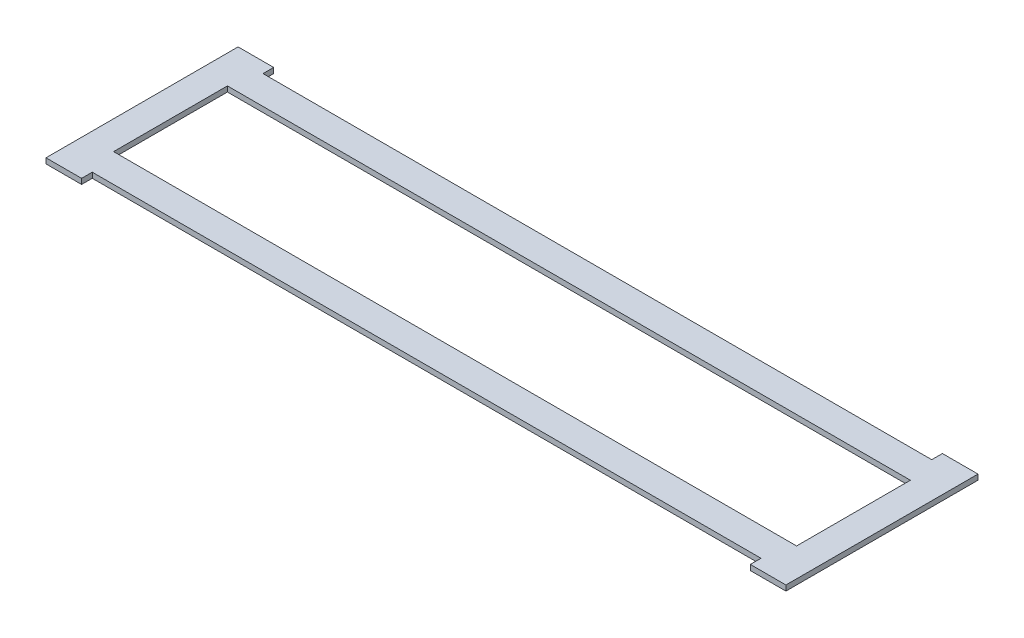
ISO-10303-21;
HEADER;
FILE_DESCRIPTION(('STEP AP214'),'2;1');
FILE_NAME('part.step','',(''),(''),'','','');
FILE_SCHEMA(('AUTOMOTIVE_DESIGN { 1 0 10303 214 1 1 1 1 }'));
ENDSEC;
DATA;
#1=APPLICATION_CONTEXT('core data for automotive mechanical design processes');
#2=APPLICATION_PROTOCOL_DEFINITION('international standard','automotive_design',2000,#1);
#3=PRODUCT_CONTEXT('',#1,'mechanical');
#4=PRODUCT('Part','Part','',(#3));
#5=PRODUCT_RELATED_PRODUCT_CATEGORY('part','',(#4));
#6=PRODUCT_DEFINITION_FORMATION('','',#4);
#7=PRODUCT_DEFINITION_CONTEXT('part definition',#1,'design');
#8=PRODUCT_DEFINITION('design','',#6,#7);
#9=PRODUCT_DEFINITION_SHAPE('','',#8);
#10=(LENGTH_UNIT() NAMED_UNIT(*) SI_UNIT(.MILLI.,.METRE.));
#11=(NAMED_UNIT(*) PLANE_ANGLE_UNIT() SI_UNIT($,.RADIAN.));
#12=(NAMED_UNIT(*) SI_UNIT($,.STERADIAN.) SOLID_ANGLE_UNIT());
#13=UNCERTAINTY_MEASURE_WITH_UNIT(LENGTH_MEASURE(1.E-05),#10,'distance_accuracy_value','');
#14=(GEOMETRIC_REPRESENTATION_CONTEXT(3) GLOBAL_UNCERTAINTY_ASSIGNED_CONTEXT((#13)) GLOBAL_UNIT_ASSIGNED_CONTEXT((#10,
#11,#12)) REPRESENTATION_CONTEXT('',''));
#15=CARTESIAN_POINT('',(0.,0.,0.));
#16=DIRECTION('',(0.,0.,1.));
#17=DIRECTION('',(1.,0.,0.));
#18=AXIS2_PLACEMENT_3D('',#15,#16,#17);
#19=CARTESIAN_POINT('',(0.,3.,-32.));
#20=DIRECTION('',(0.,0.,-1.));
#21=DIRECTION('',(-1.,0.,0.));
#22=AXIS2_PLACEMENT_3D('',#19,#20,#21);
#23=PLANE('',#22);
#24=DIRECTION('',(1.,0.,0.));
#25=VECTOR('',#24,1.);
#26=CARTESIAN_POINT('',(0.,0.,-32.));
#27=LINE('',#26,#25);
#28=CARTESIAN_POINT('',(-192.,0.,-32.));
#29=VERTEX_POINT('',#28);
#30=CARTESIAN_POINT('',(192.,0.,-32.));
#31=VERTEX_POINT('',#30);
#32=EDGE_CURVE('E214',#29,#31,#27,.T.);
#33=ORIENTED_EDGE('',*,*,#32,.T.);
#34=DIRECTION('',(0.,-1.,0.));
#35=VECTOR('',#34,1.);
#36=CARTESIAN_POINT('',(192.,3.,-32.));
#37=LINE('',#36,#35);
#38=CARTESIAN_POINT('',(192.,3.,-32.));
#39=VERTEX_POINT('',#38);
#40=EDGE_CURVE('E11',#39,#31,#37,.T.);
#41=ORIENTED_EDGE('',*,*,#40,.F.);
#42=DIRECTION('',(1.,0.,0.));
#43=VECTOR('',#42,1.);
#44=CARTESIAN_POINT('',(0.,3.,-32.));
#45=LINE('',#44,#43);
#46=CARTESIAN_POINT('',(-192.,3.,-32.));
#47=VERTEX_POINT('',#46);
#48=EDGE_CURVE('E163',#47,#39,#45,.T.);
#49=ORIENTED_EDGE('',*,*,#48,.F.);
#50=DIRECTION('',(0.,-1.,0.));
#51=VECTOR('',#50,1.);
#52=CARTESIAN_POINT('',(-192.,3.,-32.));
#53=LINE('',#52,#51);
#54=EDGE_CURVE('E55',#47,#29,#53,.T.);
#55=ORIENTED_EDGE('',*,*,#54,.T.);
#56=EDGE_LOOP('',(#33,#41,#49,#55));
#57=FACE_BOUND('',#56,.T.);
#58=ADVANCED_FACE('F36',(#57),#23,.F.);
#59=CARTESIAN_POINT('',(192.,3.,0.));
#60=DIRECTION('',(1.,0.,0.));
#61=DIRECTION('',(0.,0.,-1.));
#62=AXIS2_PLACEMENT_3D('',#59,#60,#61);
#63=PLANE('',#62);
#64=DIRECTION('',(0.,0.,1.));
#65=VECTOR('',#64,1.);
#66=CARTESIAN_POINT('',(192.,0.,0.));
#67=LINE('',#66,#65);
#68=CARTESIAN_POINT('',(192.,0.,32.));
#69=VERTEX_POINT('',#68);
#70=EDGE_CURVE('E169',#31,#69,#67,.T.);
#71=ORIENTED_EDGE('',*,*,#70,.T.);
#72=DIRECTION('',(0.,-1.,0.));
#73=VECTOR('',#72,1.);
#74=CARTESIAN_POINT('',(192.,3.,32.));
#75=LINE('',#74,#73);
#76=CARTESIAN_POINT('',(192.,3.,32.));
#77=VERTEX_POINT('',#76);
#78=EDGE_CURVE('E46',#77,#69,#75,.T.);
#79=ORIENTED_EDGE('',*,*,#78,.F.);
#80=DIRECTION('',(0.,0.,1.));
#81=VECTOR('',#80,1.);
#82=CARTESIAN_POINT('',(192.,3.,0.));
#83=LINE('',#82,#81);
#84=EDGE_CURVE('E157',#39,#77,#83,.T.);
#85=ORIENTED_EDGE('',*,*,#84,.F.);
#86=ORIENTED_EDGE('',*,*,#40,.T.);
#87=EDGE_LOOP('',(#71,#79,#85,#86));
#88=FACE_BOUND('',#87,.T.);
#89=ADVANCED_FACE('F168',(#88),#63,.F.);
#90=CARTESIAN_POINT('',(0.,3.,32.));
#91=DIRECTION('',(0.,0.,-1.));
#92=DIRECTION('',(-1.,0.,0.));
#93=AXIS2_PLACEMENT_3D('',#90,#91,#92);
#94=PLANE('',#93);
#95=DIRECTION('',(1.,0.,0.));
#96=VECTOR('',#95,1.);
#97=CARTESIAN_POINT('',(0.,0.,32.));
#98=LINE('',#97,#96);
#99=CARTESIAN_POINT('',(-192.,0.,32.));
#100=VERTEX_POINT('',#99);
#101=EDGE_CURVE('E217',#100,#69,#98,.T.);
#102=ORIENTED_EDGE('',*,*,#101,.F.);
#103=DIRECTION('',(0.,-1.,0.));
#104=VECTOR('',#103,1.);
#105=CARTESIAN_POINT('',(-192.,3.,32.));
#106=LINE('',#105,#104);
#107=CARTESIAN_POINT('',(-192.,3.,32.));
#108=VERTEX_POINT('',#107);
#109=EDGE_CURVE('E105',#108,#100,#106,.T.);
#110=ORIENTED_EDGE('',*,*,#109,.F.);
#111=DIRECTION('',(1.,0.,0.));
#112=VECTOR('',#111,1.);
#113=CARTESIAN_POINT('',(0.,3.,32.));
#114=LINE('',#113,#112);
#115=EDGE_CURVE('E162',#108,#77,#114,.T.);
#116=ORIENTED_EDGE('',*,*,#115,.T.);
#117=ORIENTED_EDGE('',*,*,#78,.T.);
#118=EDGE_LOOP('',(#102,#110,#116,#117));
#119=FACE_BOUND('',#118,.T.);
#120=ADVANCED_FACE('F173',(#119),#94,.T.);
#121=CARTESIAN_POINT('',(208.,3.,0.));
#122=DIRECTION('',(1.,0.,0.));
#123=DIRECTION('',(0.,0.,-1.));
#124=AXIS2_PLACEMENT_3D('',#121,#122,#123);
#125=PLANE('',#124);
#126=DIRECTION('',(0.,0.,1.));
#127=VECTOR('',#126,1.);
#128=CARTESIAN_POINT('',(208.,0.,0.));
#129=LINE('',#128,#127);
#130=CARTESIAN_POINT('',(208.,0.,-54.0000000000004));
#131=VERTEX_POINT('',#130);
#132=CARTESIAN_POINT('',(208.,0.,54.0000000000003));
#133=VERTEX_POINT('',#132);
#134=EDGE_CURVE('E180',#131,#133,#129,.T.);
#135=ORIENTED_EDGE('',*,*,#134,.F.);
#136=DIRECTION('',(0.,-1.,0.));
#137=VECTOR('',#136,1.);
#138=CARTESIAN_POINT('',(208.,3.,-54.0000000000004));
#139=LINE('',#138,#137);
#140=CARTESIAN_POINT('',(208.,3.,-54.0000000000004));
#141=VERTEX_POINT('',#140);
#142=EDGE_CURVE('E40',#141,#131,#139,.T.);
#143=ORIENTED_EDGE('',*,*,#142,.F.);
#144=DIRECTION('',(0.,0.,1.));
#145=VECTOR('',#144,1.);
#146=CARTESIAN_POINT('',(208.,3.,0.));
#147=LINE('',#146,#145);
#148=CARTESIAN_POINT('',(208.,3.,54.0000000000003));
#149=VERTEX_POINT('',#148);
#150=EDGE_CURVE('E222',#141,#149,#147,.T.);
#151=ORIENTED_EDGE('',*,*,#150,.T.);
#152=DIRECTION('',(0.,-1.,0.));
#153=VECTOR('',#152,1.);
#154=CARTESIAN_POINT('',(208.,3.,54.0000000000003));
#155=LINE('',#154,#153);
#156=EDGE_CURVE('E176',#149,#133,#155,.T.);
#157=ORIENTED_EDGE('',*,*,#156,.T.);
#158=EDGE_LOOP('',(#135,#143,#151,#157));
#159=FACE_BOUND('',#158,.T.);
#160=ADVANCED_FACE('F38',(#159),#125,.T.);
#161=CARTESIAN_POINT('',(-1.12375470551405E-13,3.,-53.9999999999999));
#162=DIRECTION('',(0.,0.,1.));
#163=DIRECTION('',(1.,0.,0.));
#164=AXIS2_PLACEMENT_3D('',#161,#162,#163);
#165=PLANE('',#164);
#166=DIRECTION('',(-1.,0.,0.));
#167=VECTOR('',#166,1.);
#168=CARTESIAN_POINT('',(-1.12375470551405E-13,0.,-53.9999999999999));
#169=LINE('',#168,#167);
#170=CARTESIAN_POINT('',(187.993840169616,0.,-54.0000000000003));
#171=VERTEX_POINT('',#170);
#172=EDGE_CURVE('E183',#131,#171,#169,.T.);
#173=ORIENTED_EDGE('',*,*,#172,.T.);
#174=DIRECTION('',(0.,-1.,0.));
#175=VECTOR('',#174,1.);
#176=CARTESIAN_POINT('',(187.993840169616,3.,-54.0000000000003));
#177=LINE('',#176,#175);
#178=CARTESIAN_POINT('',(187.993840169616,3.,-54.0000000000003));
#179=VERTEX_POINT('',#178);
#180=EDGE_CURVE('E245',#179,#171,#177,.T.);
#181=ORIENTED_EDGE('',*,*,#180,.F.);
#182=DIRECTION('',(-1.,0.,0.));
#183=VECTOR('',#182,1.);
#184=CARTESIAN_POINT('',(-1.12375470551405E-13,3.,-53.9999999999999));
#185=LINE('',#184,#183);
#186=EDGE_CURVE('E253',#141,#179,#185,.T.);
#187=ORIENTED_EDGE('',*,*,#186,.F.);
#188=ORIENTED_EDGE('',*,*,#142,.T.);
#189=EDGE_LOOP('',(#173,#181,#187,#188));
#190=FACE_BOUND('',#189,.T.);
#191=ADVANCED_FACE('F252',(#190),#165,.F.);
#192=CARTESIAN_POINT('',(187.993840169616,3.,0.));
#193=DIRECTION('',(-1.,0.,0.));
#194=DIRECTION('',(0.,0.,1.));
#195=AXIS2_PLACEMENT_3D('',#192,#193,#194);
#196=PLANE('',#195);
#197=DIRECTION('',(0.,0.,-1.));
#198=VECTOR('',#197,1.);
#199=CARTESIAN_POINT('',(187.993840169616,0.,0.));
#200=LINE('',#199,#198);
#201=CARTESIAN_POINT('',(187.993840169616,0.,-48.));
#202=VERTEX_POINT('',#201);
#203=EDGE_CURVE('E186',#202,#171,#200,.T.);
#204=ORIENTED_EDGE('',*,*,#203,.F.);
#205=DIRECTION('',(0.,-1.,0.));
#206=VECTOR('',#205,1.);
#207=CARTESIAN_POINT('',(187.993840169616,3.,-48.));
#208=LINE('',#207,#206);
#209=CARTESIAN_POINT('',(187.993840169616,3.,-48.));
#210=VERTEX_POINT('',#209);
#211=EDGE_CURVE('E244',#210,#202,#208,.T.);
#212=ORIENTED_EDGE('',*,*,#211,.F.);
#213=DIRECTION('',(0.,0.,-1.));
#214=VECTOR('',#213,1.);
#215=CARTESIAN_POINT('',(187.993840169616,3.,0.));
#216=LINE('',#215,#214);
#217=EDGE_CURVE('E494',#210,#179,#216,.T.);
#218=ORIENTED_EDGE('',*,*,#217,.T.);
#219=ORIENTED_EDGE('',*,*,#180,.T.);
#220=EDGE_LOOP('',(#204,#212,#218,#219));
#221=FACE_BOUND('',#220,.T.);
#222=ADVANCED_FACE('F311',(#221),#196,.T.);
#223=CARTESIAN_POINT('',(0.,3.,-48.));
#224=DIRECTION('',(0.,0.,-1.));
#225=DIRECTION('',(-1.,0.,0.));
#226=AXIS2_PLACEMENT_3D('',#223,#224,#225);
#227=PLANE('',#226);
#228=DIRECTION('',(1.,0.,0.));
#229=VECTOR('',#228,1.);
#230=CARTESIAN_POINT('',(0.,0.,-48.));
#231=LINE('',#230,#229);
#232=CARTESIAN_POINT('',(-187.993840169617,0.,-48.));
#233=VERTEX_POINT('',#232);
#234=EDGE_CURVE('E189',#233,#202,#231,.T.);
#235=ORIENTED_EDGE('',*,*,#234,.F.);
#236=DIRECTION('',(0.,-1.,0.));
#237=VECTOR('',#236,1.);
#238=CARTESIAN_POINT('',(-187.993840169617,3.,-48.));
#239=LINE('',#238,#237);
#240=CARTESIAN_POINT('',(-187.993840169617,3.,-48.));
#241=VERTEX_POINT('',#240);
#242=EDGE_CURVE('E242',#241,#233,#239,.T.);
#243=ORIENTED_EDGE('',*,*,#242,.F.);
#244=DIRECTION('',(1.,0.,0.));
#245=VECTOR('',#244,1.);
#246=CARTESIAN_POINT('',(0.,3.,-48.));
#247=LINE('',#246,#245);
#248=EDGE_CURVE('E309',#241,#210,#247,.T.);
#249=ORIENTED_EDGE('',*,*,#248,.T.);
#250=ORIENTED_EDGE('',*,*,#211,.T.);
#251=EDGE_LOOP('',(#235,#243,#249,#250));
#252=FACE_BOUND('',#251,.T.);
#253=ADVANCED_FACE('F305',(#252),#227,.T.);
#254=CARTESIAN_POINT('',(-187.993840169617,3.,0.));
#255=DIRECTION('',(-1.,0.,0.));
#256=DIRECTION('',(0.,0.,1.));
#257=AXIS2_PLACEMENT_3D('',#254,#255,#256);
#258=PLANE('',#257);
#259=DIRECTION('',(0.,0.,-1.));
#260=VECTOR('',#259,1.);
#261=CARTESIAN_POINT('',(-187.993840169617,0.,0.));
#262=LINE('',#261,#260);
#263=CARTESIAN_POINT('',(-187.993840169617,0.,-54.));
#264=VERTEX_POINT('',#263);
#265=EDGE_CURVE('E192',#233,#264,#262,.T.);
#266=ORIENTED_EDGE('',*,*,#265,.T.);
#267=DIRECTION('',(0.,-1.,0.));
#268=VECTOR('',#267,1.);
#269=CARTESIAN_POINT('',(-187.993840169617,3.,-54.));
#270=LINE('',#269,#268);
#271=CARTESIAN_POINT('',(-187.993840169617,3.,-54.));
#272=VERTEX_POINT('',#271);
#273=EDGE_CURVE('E240',#272,#264,#270,.T.);
#274=ORIENTED_EDGE('',*,*,#273,.F.);
#275=DIRECTION('',(0.,0.,-1.));
#276=VECTOR('',#275,1.);
#277=CARTESIAN_POINT('',(-187.993840169617,3.,0.));
#278=LINE('',#277,#276);
#279=EDGE_CURVE('E499',#241,#272,#278,.T.);
#280=ORIENTED_EDGE('',*,*,#279,.F.);
#281=ORIENTED_EDGE('',*,*,#242,.T.);
#282=EDGE_LOOP('',(#266,#274,#280,#281));
#283=FACE_BOUND('',#282,.T.);
#284=ADVANCED_FACE('F318',(#283),#258,.F.);
#285=CARTESIAN_POINT('',(0.,3.,-54.));
#286=DIRECTION('',(0.,0.,-1.));
#287=DIRECTION('',(-1.,0.,0.));
#288=AXIS2_PLACEMENT_3D('',#285,#286,#287);
#289=PLANE('',#288);
#290=DIRECTION('',(1.,0.,0.));
#291=VECTOR('',#290,1.);
#292=CARTESIAN_POINT('',(0.,0.,-54.));
#293=LINE('',#292,#291);
#294=CARTESIAN_POINT('',(-208.,0.,-54.));
#295=VERTEX_POINT('',#294);
#296=EDGE_CURVE('E195',#295,#264,#293,.T.);
#297=ORIENTED_EDGE('',*,*,#296,.F.);
#298=DIRECTION('',(0.,-1.,0.));
#299=VECTOR('',#298,1.);
#300=CARTESIAN_POINT('',(-208.,3.,-54.));
#301=LINE('',#300,#299);
#302=CARTESIAN_POINT('',(-208.,3.,-54.));
#303=VERTEX_POINT('',#302);
#304=EDGE_CURVE('E238',#303,#295,#301,.T.);
#305=ORIENTED_EDGE('',*,*,#304,.F.);
#306=DIRECTION('',(1.,0.,0.));
#307=VECTOR('',#306,1.);
#308=CARTESIAN_POINT('',(0.,3.,-54.));
#309=LINE('',#308,#307);
#310=EDGE_CURVE('E299',#303,#272,#309,.T.);
#311=ORIENTED_EDGE('',*,*,#310,.T.);
#312=ORIENTED_EDGE('',*,*,#273,.T.);
#313=EDGE_LOOP('',(#297,#305,#311,#312));
#314=FACE_BOUND('',#313,.T.);
#315=ADVANCED_FACE('F298',(#314),#289,.T.);
#316=CARTESIAN_POINT('',(-208.,3.,0.));
#317=DIRECTION('',(1.,0.,0.));
#318=DIRECTION('',(0.,0.,-1.));
#319=AXIS2_PLACEMENT_3D('',#316,#317,#318);
#320=PLANE('',#319);
#321=DIRECTION('',(0.,0.,1.));
#322=VECTOR('',#321,1.);
#323=CARTESIAN_POINT('',(-208.,0.,0.));
#324=LINE('',#323,#322);
#325=CARTESIAN_POINT('',(-208.,0.,54.));
#326=VERTEX_POINT('',#325);
#327=EDGE_CURVE('E198',#295,#326,#324,.T.);
#328=ORIENTED_EDGE('',*,*,#327,.T.);
#329=DIRECTION('',(0.,-1.,0.));
#330=VECTOR('',#329,1.);
#331=CARTESIAN_POINT('',(-208.,3.,54.));
#332=LINE('',#331,#330);
#333=CARTESIAN_POINT('',(-208.,3.,54.));
#334=VERTEX_POINT('',#333);
#335=EDGE_CURVE('E235',#334,#326,#332,.T.);
#336=ORIENTED_EDGE('',*,*,#335,.F.);
#337=DIRECTION('',(0.,0.,1.));
#338=VECTOR('',#337,1.);
#339=CARTESIAN_POINT('',(-208.,3.,0.));
#340=LINE('',#339,#338);
#341=EDGE_CURVE('E294',#303,#334,#340,.T.);
#342=ORIENTED_EDGE('',*,*,#341,.F.);
#343=ORIENTED_EDGE('',*,*,#304,.T.);
#344=EDGE_LOOP('',(#328,#336,#342,#343));
#345=FACE_BOUND('',#344,.T.);
#346=ADVANCED_FACE('F293',(#345),#320,.F.);
#347=CARTESIAN_POINT('',(0.,3.,54.));
#348=DIRECTION('',(0.,0.,-1.));
#349=DIRECTION('',(-1.,0.,0.));
#350=AXIS2_PLACEMENT_3D('',#347,#348,#349);
#351=PLANE('',#350);
#352=DIRECTION('',(1.,0.,0.));
#353=VECTOR('',#352,1.);
#354=CARTESIAN_POINT('',(0.,0.,54.));
#355=LINE('',#354,#353);
#356=CARTESIAN_POINT('',(-187.993840169617,0.,54.));
#357=VERTEX_POINT('',#356);
#358=EDGE_CURVE('E200',#326,#357,#355,.T.);
#359=ORIENTED_EDGE('',*,*,#358,.T.);
#360=DIRECTION('',(0.,-1.,0.));
#361=VECTOR('',#360,1.);
#362=CARTESIAN_POINT('',(-187.993840169617,3.,54.));
#363=LINE('',#362,#361);
#364=CARTESIAN_POINT('',(-187.993840169617,3.,54.));
#365=VERTEX_POINT('',#364);
#366=EDGE_CURVE('E233',#365,#357,#363,.T.);
#367=ORIENTED_EDGE('',*,*,#366,.F.);
#368=DIRECTION('',(1.,0.,0.));
#369=VECTOR('',#368,1.);
#370=CARTESIAN_POINT('',(0.,3.,54.));
#371=LINE('',#370,#369);
#372=EDGE_CURVE('E290',#334,#365,#371,.T.);
#373=ORIENTED_EDGE('',*,*,#372,.F.);
#374=ORIENTED_EDGE('',*,*,#335,.T.);
#375=EDGE_LOOP('',(#359,#367,#373,#374));
#376=FACE_BOUND('',#375,.T.);
#377=ADVANCED_FACE('F287',(#376),#351,.F.);
#378=CARTESIAN_POINT('',(-187.993840169617,3.,0.));
#379=DIRECTION('',(1.,0.,0.));
#380=DIRECTION('',(0.,0.,-1.));
#381=AXIS2_PLACEMENT_3D('',#378,#379,#380);
#382=PLANE('',#381);
#383=DIRECTION('',(0.,0.,1.));
#384=VECTOR('',#383,1.);
#385=CARTESIAN_POINT('',(-187.993840169617,0.,0.));
#386=LINE('',#385,#384);
#387=CARTESIAN_POINT('',(-187.993840169617,0.,48.));
#388=VERTEX_POINT('',#387);
#389=EDGE_CURVE('E203',#388,#357,#386,.T.);
#390=ORIENTED_EDGE('',*,*,#389,.F.);
#391=DIRECTION('',(0.,-1.,0.));
#392=VECTOR('',#391,1.);
#393=CARTESIAN_POINT('',(-187.993840169617,3.,48.));
#394=LINE('',#393,#392);
#395=CARTESIAN_POINT('',(-187.993840169617,3.,48.));
#396=VERTEX_POINT('',#395);
#397=EDGE_CURVE('E231',#396,#388,#394,.T.);
#398=ORIENTED_EDGE('',*,*,#397,.F.);
#399=DIRECTION('',(0.,0.,1.));
#400=VECTOR('',#399,1.);
#401=CARTESIAN_POINT('',(-187.993840169617,3.,0.));
#402=LINE('',#401,#400);
#403=EDGE_CURVE('E281',#396,#365,#402,.T.);
#404=ORIENTED_EDGE('',*,*,#403,.T.);
#405=ORIENTED_EDGE('',*,*,#366,.T.);
#406=EDGE_LOOP('',(#390,#398,#404,#405));
#407=FACE_BOUND('',#406,.T.);
#408=ADVANCED_FACE('F280',(#407),#382,.T.);
#409=CARTESIAN_POINT('',(0.,3.,48.));
#410=DIRECTION('',(0.,0.,-1.));
#411=DIRECTION('',(-1.,0.,0.));
#412=AXIS2_PLACEMENT_3D('',#409,#410,#411);
#413=PLANE('',#412);
#414=DIRECTION('',(1.,0.,0.));
#415=VECTOR('',#414,1.);
#416=CARTESIAN_POINT('',(0.,0.,48.));
#417=LINE('',#416,#415);
#418=CARTESIAN_POINT('',(187.993840169616,0.,48.));
#419=VERTEX_POINT('',#418);
#420=EDGE_CURVE('E206',#388,#419,#417,.T.);
#421=ORIENTED_EDGE('',*,*,#420,.T.);
#422=DIRECTION('',(0.,-1.,0.));
#423=VECTOR('',#422,1.);
#424=CARTESIAN_POINT('',(187.993840169616,3.,48.));
#425=LINE('',#424,#423);
#426=CARTESIAN_POINT('',(187.993840169616,3.,48.));
#427=VERTEX_POINT('',#426);
#428=EDGE_CURVE('E228',#427,#419,#425,.T.);
#429=ORIENTED_EDGE('',*,*,#428,.F.);
#430=DIRECTION('',(1.,0.,0.));
#431=VECTOR('',#430,1.);
#432=CARTESIAN_POINT('',(0.,3.,48.));
#433=LINE('',#432,#431);
#434=EDGE_CURVE('E276',#396,#427,#433,.T.);
#435=ORIENTED_EDGE('',*,*,#434,.F.);
#436=ORIENTED_EDGE('',*,*,#397,.T.);
#437=EDGE_LOOP('',(#421,#429,#435,#436));
#438=FACE_BOUND('',#437,.T.);
#439=ADVANCED_FACE('F275',(#438),#413,.F.);
#440=CARTESIAN_POINT('',(187.993840169616,3.,0.));
#441=DIRECTION('',(1.,0.,0.));
#442=DIRECTION('',(0.,0.,-1.));
#443=AXIS2_PLACEMENT_3D('',#440,#441,#442);
#444=PLANE('',#443);
#445=DIRECTION('',(0.,0.,1.));
#446=VECTOR('',#445,1.);
#447=CARTESIAN_POINT('',(187.993840169616,0.,0.));
#448=LINE('',#447,#446);
#449=CARTESIAN_POINT('',(187.993840169616,0.,54.0000000000003));
#450=VERTEX_POINT('',#449);
#451=EDGE_CURVE('E208',#419,#450,#448,.T.);
#452=ORIENTED_EDGE('',*,*,#451,.T.);
#453=DIRECTION('',(0.,-1.,0.));
#454=VECTOR('',#453,1.);
#455=CARTESIAN_POINT('',(187.993840169616,3.,54.0000000000003));
#456=LINE('',#455,#454);
#457=CARTESIAN_POINT('',(187.993840169616,3.,54.0000000000003));
#458=VERTEX_POINT('',#457);
#459=EDGE_CURVE('E226',#458,#450,#456,.T.);
#460=ORIENTED_EDGE('',*,*,#459,.F.);
#461=DIRECTION('',(0.,0.,1.));
#462=VECTOR('',#461,1.);
#463=CARTESIAN_POINT('',(187.993840169616,3.,0.));
#464=LINE('',#463,#462);
#465=EDGE_CURVE('E272',#427,#458,#464,.T.);
#466=ORIENTED_EDGE('',*,*,#465,.F.);
#467=ORIENTED_EDGE('',*,*,#428,.T.);
#468=EDGE_LOOP('',(#452,#460,#466,#467));
#469=FACE_BOUND('',#468,.T.);
#470=ADVANCED_FACE('F269',(#469),#444,.F.);
#471=CARTESIAN_POINT('',(-1.12375470551405E-13,3.,53.9999999999999));
#472=DIRECTION('',(0.,0.,1.));
#473=DIRECTION('',(1.,0.,0.));
#474=AXIS2_PLACEMENT_3D('',#471,#472,#473);
#475=PLANE('',#474);
#476=DIRECTION('',(-1.,0.,0.));
#477=VECTOR('',#476,1.);
#478=CARTESIAN_POINT('',(-1.12375470551405E-13,0.,53.9999999999999));
#479=LINE('',#478,#477);
#480=EDGE_CURVE('E211',#133,#450,#479,.T.);
#481=ORIENTED_EDGE('',*,*,#480,.F.);
#482=ORIENTED_EDGE('',*,*,#156,.F.);
#483=DIRECTION('',(-1.,0.,0.));
#484=VECTOR('',#483,1.);
#485=CARTESIAN_POINT('',(-1.12375470551405E-13,3.,53.9999999999999));
#486=LINE('',#485,#484);
#487=EDGE_CURVE('E263',#149,#458,#486,.T.);
#488=ORIENTED_EDGE('',*,*,#487,.T.);
#489=ORIENTED_EDGE('',*,*,#459,.T.);
#490=EDGE_LOOP('',(#481,#482,#488,#489));
#491=FACE_BOUND('',#490,.T.);
#492=ADVANCED_FACE('F262',(#491),#475,.T.);
#493=CARTESIAN_POINT('',(-192.,3.,0.));
#494=DIRECTION('',(1.,0.,0.));
#495=DIRECTION('',(0.,0.,-1.));
#496=AXIS2_PLACEMENT_3D('',#493,#494,#495);
#497=PLANE('',#496);
#498=DIRECTION('',(0.,0.,1.));
#499=VECTOR('',#498,1.);
#500=CARTESIAN_POINT('',(-192.,0.,0.));
#501=LINE('',#500,#499);
#502=EDGE_CURVE('E219',#29,#100,#501,.T.);
#503=ORIENTED_EDGE('',*,*,#502,.F.);
#504=ORIENTED_EDGE('',*,*,#54,.F.);
#505=DIRECTION('',(0.,0.,1.));
#506=VECTOR('',#505,1.);
#507=CARTESIAN_POINT('',(-192.,3.,0.));
#508=LINE('',#507,#506);
#509=EDGE_CURVE('E174',#47,#108,#508,.T.);
#510=ORIENTED_EDGE('',*,*,#509,.T.);
#511=ORIENTED_EDGE('',*,*,#109,.T.);
#512=EDGE_LOOP('',(#503,#504,#510,#511));
#513=FACE_BOUND('',#512,.T.);
#514=ADVANCED_FACE('F330',(#513),#497,.T.);
#515=CARTESIAN_POINT('',(0.,3.,0.));
#516=DIRECTION('',(0.,1.,0.));
#517=DIRECTION('',(0.,0.,1.));
#518=AXIS2_PLACEMENT_3D('',#515,#516,#517);
#519=PLANE('',#518);
#520=ORIENTED_EDGE('',*,*,#150,.F.);
#521=ORIENTED_EDGE('',*,*,#186,.T.);
#522=ORIENTED_EDGE('',*,*,#217,.F.);
#523=ORIENTED_EDGE('',*,*,#248,.F.);
#524=ORIENTED_EDGE('',*,*,#279,.T.);
#525=ORIENTED_EDGE('',*,*,#310,.F.);
#526=ORIENTED_EDGE('',*,*,#341,.T.);
#527=ORIENTED_EDGE('',*,*,#372,.T.);
#528=ORIENTED_EDGE('',*,*,#403,.F.);
#529=ORIENTED_EDGE('',*,*,#434,.T.);
#530=ORIENTED_EDGE('',*,*,#465,.T.);
#531=ORIENTED_EDGE('',*,*,#487,.F.);
#532=EDGE_LOOP('',(#520,#521,#522,#523,#524,#525,#526,#527,#528,#529,#530,#531));
#533=FACE_BOUND('',#532,.T.);
#534=ORIENTED_EDGE('',*,*,#48,.T.);
#535=ORIENTED_EDGE('',*,*,#84,.T.);
#536=ORIENTED_EDGE('',*,*,#115,.F.);
#537=ORIENTED_EDGE('',*,*,#509,.F.);
#538=EDGE_LOOP('',(#534,#535,#536,#537));
#539=FACE_BOUND('',#538,.T.);
#540=ADVANCED_FACE('F159',(#533,#539),#519,.T.);
#541=CARTESIAN_POINT('',(0.,0.,0.));
#542=DIRECTION('',(0.,1.,0.));
#543=DIRECTION('',(0.,0.,1.));
#544=AXIS2_PLACEMENT_3D('',#541,#542,#543);
#545=PLANE('',#544);
#546=ORIENTED_EDGE('',*,*,#134,.T.);
#547=ORIENTED_EDGE('',*,*,#480,.T.);
#548=ORIENTED_EDGE('',*,*,#451,.F.);
#549=ORIENTED_EDGE('',*,*,#420,.F.);
#550=ORIENTED_EDGE('',*,*,#389,.T.);
#551=ORIENTED_EDGE('',*,*,#358,.F.);
#552=ORIENTED_EDGE('',*,*,#327,.F.);
#553=ORIENTED_EDGE('',*,*,#296,.T.);
#554=ORIENTED_EDGE('',*,*,#265,.F.);
#555=ORIENTED_EDGE('',*,*,#234,.T.);
#556=ORIENTED_EDGE('',*,*,#203,.T.);
#557=ORIENTED_EDGE('',*,*,#172,.F.);
#558=EDGE_LOOP('',(#546,#547,#548,#549,#550,#551,#552,#553,#554,#555,#556,#557));
#559=FACE_BOUND('',#558,.T.);
#560=ORIENTED_EDGE('',*,*,#32,.F.);
#561=ORIENTED_EDGE('',*,*,#502,.T.);
#562=ORIENTED_EDGE('',*,*,#101,.T.);
#563=ORIENTED_EDGE('',*,*,#70,.F.);
#564=EDGE_LOOP('',(#560,#561,#562,#563));
#565=FACE_BOUND('',#564,.T.);
#566=ADVANCED_FACE('F256',(#559,#565),#545,.F.);
#567=CLOSED_SHELL('',(#58,#89,#120,#160,#191,#222,#253,#284,#315,#346,#377,#408,#439,#470,#492,
#514,#540,#566));
#568=MANIFOLD_SOLID_BREP('B2',#567);
#569=ADVANCED_BREP_SHAPE_REPRESENTATION('',(#18,#568),#14);
#570=SHAPE_DEFINITION_REPRESENTATION(#9,#569);
ENDSEC;
END-ISO-10303-21;
